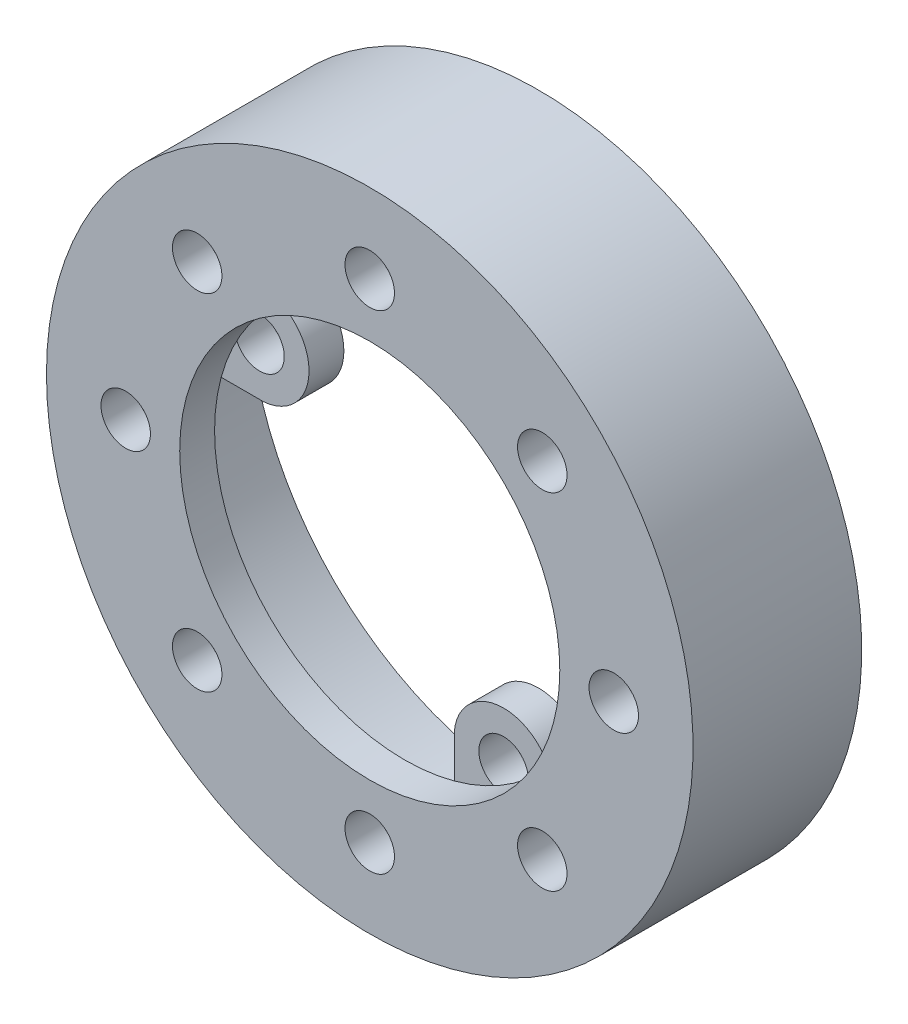
ISO-10303-21;
HEADER;
FILE_DESCRIPTION(('STEP AP214'),'2;1');
FILE_NAME('part.step','',(''),(''),'','','');
FILE_SCHEMA(('AUTOMOTIVE_DESIGN { 1 0 10303 214 1 1 1 1 }'));
ENDSEC;
DATA;
#1=APPLICATION_CONTEXT('core data for automotive mechanical design processes');
#2=APPLICATION_PROTOCOL_DEFINITION('international standard','automotive_design',2000,#1);
#3=PRODUCT_CONTEXT('',#1,'mechanical');
#4=PRODUCT('Part','Part','',(#3));
#5=PRODUCT_RELATED_PRODUCT_CATEGORY('part','',(#4));
#6=PRODUCT_DEFINITION_FORMATION('','',#4);
#7=PRODUCT_DEFINITION_CONTEXT('part definition',#1,'design');
#8=PRODUCT_DEFINITION('design','',#6,#7);
#9=PRODUCT_DEFINITION_SHAPE('','',#8);
#10=(LENGTH_UNIT() NAMED_UNIT(*) SI_UNIT(.MILLI.,.METRE.));
#11=(NAMED_UNIT(*) PLANE_ANGLE_UNIT() SI_UNIT($,.RADIAN.));
#12=(NAMED_UNIT(*) SI_UNIT($,.STERADIAN.) SOLID_ANGLE_UNIT());
#13=UNCERTAINTY_MEASURE_WITH_UNIT(LENGTH_MEASURE(1.E-05),#10,'distance_accuracy_value','');
#14=(GEOMETRIC_REPRESENTATION_CONTEXT(3) GLOBAL_UNCERTAINTY_ASSIGNED_CONTEXT((#13)) GLOBAL_UNIT_ASSIGNED_CONTEXT((#10,
#11,#12)) REPRESENTATION_CONTEXT('',''));
#15=CARTESIAN_POINT('',(0.,0.,0.));
#16=DIRECTION('',(0.,0.,1.));
#17=DIRECTION('',(1.,0.,0.));
#18=AXIS2_PLACEMENT_3D('',#15,#16,#17);
#19=CARTESIAN_POINT('',(0.,0.,-38.1));
#20=DIRECTION('',(0.,0.,-1.));
#21=DIRECTION('',(-1.,0.,0.));
#22=AXIS2_PLACEMENT_3D('',#19,#20,#21);
#23=CYLINDRICAL_SURFACE('',#22,65.278);
#24=CARTESIAN_POINT('',(0.,0.,-38.1));
#25=DIRECTION('',(0.,0.,-1.));
#26=DIRECTION('',(-1.,0.,0.));
#27=AXIS2_PLACEMENT_3D('',#24,#25,#26);
#28=CIRCLE('',#27,65.278);
#29=CARTESIAN_POINT('',(11.1349764420715,64.3212996108949,-38.1));
#30=VERTEX_POINT('',#29);
#31=CARTESIAN_POINT('',(64.3212996108948,11.1349764420721,-38.1));
#32=VERTEX_POINT('',#31);
#33=EDGE_CURVE('E11',#30,#32,#28,.T.);
#34=ORIENTED_EDGE('',*,*,#33,.T.);
#35=DIRECTION('',(0.,0.,-1.));
#36=VECTOR('',#35,1.);
#37=CARTESIAN_POINT('',(64.3212996108948,11.1349764420721,-30.226));
#38=LINE('',#37,#36);
#39=CARTESIAN_POINT('',(64.3212996108948,11.1349764420721,-30.226));
#40=VERTEX_POINT('',#39);
#41=EDGE_CURVE('E47',#40,#32,#38,.T.);
#42=ORIENTED_EDGE('',*,*,#41,.F.);
#43=CARTESIAN_POINT('',(0.,0.,-30.226));
#44=DIRECTION('',(0.,0.,-1.));
#45=DIRECTION('',(-1.,0.,0.));
#46=AXIS2_PLACEMENT_3D('',#43,#44,#45);
#47=CIRCLE('',#46,65.278);
#48=CARTESIAN_POINT('',(64.3212996108951,-11.1349764420708,-30.226));
#49=VERTEX_POINT('',#48);
#50=EDGE_CURVE('E51',#40,#49,#47,.T.);
#51=ORIENTED_EDGE('',*,*,#50,.T.);
#52=DIRECTION('',(0.,0.,-1.));
#53=VECTOR('',#52,1.);
#54=CARTESIAN_POINT('',(64.3212996108951,-11.1349764420708,-30.226));
#55=LINE('',#54,#53);
#56=CARTESIAN_POINT('',(64.3212996108951,-11.1349764420708,-38.1));
#57=VERTEX_POINT('',#56);
#58=EDGE_CURVE('E156',#49,#57,#55,.T.);
#59=ORIENTED_EDGE('',*,*,#58,.T.);
#60=CARTESIAN_POINT('',(11.1349764420719,-64.3212996108949,-38.1));
#61=VERTEX_POINT('',#60);
#62=EDGE_CURVE('E40',#57,#61,#28,.T.);
#63=ORIENTED_EDGE('',*,*,#62,.T.);
#64=DIRECTION('',(0.,0.,-1.));
#65=VECTOR('',#64,1.);
#66=CARTESIAN_POINT('',(11.1349764420719,-64.3212996108949,-30.226));
#67=LINE('',#66,#65);
#68=CARTESIAN_POINT('',(11.1349764420719,-64.3212996108949,-30.226));
#69=VERTEX_POINT('',#68);
#70=EDGE_CURVE('E208',#69,#61,#67,.T.);
#71=ORIENTED_EDGE('',*,*,#70,.F.);
#72=CARTESIAN_POINT('',(0.,0.,-30.226));
#73=DIRECTION('',(0.,0.,-1.));
#74=DIRECTION('',(-1.,0.,0.));
#75=AXIS2_PLACEMENT_3D('',#72,#73,#74);
#76=CIRCLE('',#75,65.278);
#77=CARTESIAN_POINT('',(-11.134976442071,-64.321299610895,-30.226));
#78=VERTEX_POINT('',#77);
#79=EDGE_CURVE('E188',#69,#78,#76,.T.);
#80=ORIENTED_EDGE('',*,*,#79,.T.);
#81=DIRECTION('',(0.,0.,-1.));
#82=VECTOR('',#81,1.);
#83=CARTESIAN_POINT('',(-11.134976442071,-64.321299610895,-30.226));
#84=LINE('',#83,#82);
#85=CARTESIAN_POINT('',(-11.134976442071,-64.321299610895,-38.1));
#86=VERTEX_POINT('',#85);
#87=EDGE_CURVE('E200',#78,#86,#84,.T.);
#88=ORIENTED_EDGE('',*,*,#87,.T.);
#89=CARTESIAN_POINT('',(-64.3212996108949,-11.1349764420717,-38.1));
#90=VERTEX_POINT('',#89);
#91=EDGE_CURVE('E352',#86,#90,#28,.T.);
#92=ORIENTED_EDGE('',*,*,#91,.T.);
#93=DIRECTION('',(0.,0.,-1.));
#94=VECTOR('',#93,1.);
#95=CARTESIAN_POINT('',(-64.3212996108949,-11.1349764420717,-30.226));
#96=LINE('',#95,#94);
#97=CARTESIAN_POINT('',(-64.3212996108949,-11.1349764420717,-30.226));
#98=VERTEX_POINT('',#97);
#99=EDGE_CURVE('E244',#98,#90,#96,.T.);
#100=ORIENTED_EDGE('',*,*,#99,.F.);
#101=CARTESIAN_POINT('',(0.,0.,-30.226));
#102=DIRECTION('',(0.,0.,-1.));
#103=DIRECTION('',(-1.,0.,0.));
#104=AXIS2_PLACEMENT_3D('',#101,#102,#103);
#105=CIRCLE('',#104,65.278);
#106=CARTESIAN_POINT('',(-64.321299610895,11.1349764420712,-30.226));
#107=VERTEX_POINT('',#106);
#108=EDGE_CURVE('E224',#98,#107,#105,.T.);
#109=ORIENTED_EDGE('',*,*,#108,.T.);
#110=DIRECTION('',(0.,0.,-1.));
#111=VECTOR('',#110,1.);
#112=CARTESIAN_POINT('',(-64.321299610895,11.1349764420712,-30.226));
#113=LINE('',#112,#111);
#114=CARTESIAN_POINT('',(-64.321299610895,11.1349764420712,-38.1));
#115=VERTEX_POINT('',#114);
#116=EDGE_CURVE('E236',#107,#115,#113,.T.);
#117=ORIENTED_EDGE('',*,*,#116,.T.);
#118=CARTESIAN_POINT('',(-11.1349764420715,64.3212996108949,-38.1));
#119=VERTEX_POINT('',#118);
#120=EDGE_CURVE('E41',#115,#119,#28,.T.);
#121=ORIENTED_EDGE('',*,*,#120,.T.);
#122=DIRECTION('',(0.,0.,-1.));
#123=VECTOR('',#122,1.);
#124=CARTESIAN_POINT('',(-11.1349764420715,64.3212996108949,-30.226));
#125=LINE('',#124,#123);
#126=CARTESIAN_POINT('',(-11.1349764420715,64.3212996108949,-30.226));
#127=VERTEX_POINT('',#126);
#128=EDGE_CURVE('E280',#127,#119,#125,.T.);
#129=ORIENTED_EDGE('',*,*,#128,.F.);
#130=CARTESIAN_POINT('',(0.,0.,-30.226));
#131=DIRECTION('',(0.,0.,-1.));
#132=DIRECTION('',(-1.,0.,0.));
#133=AXIS2_PLACEMENT_3D('',#130,#131,#132);
#134=CIRCLE('',#133,65.278);
#135=CARTESIAN_POINT('',(11.1349764420715,64.3212996108949,-30.226));
#136=VERTEX_POINT('',#135);
#137=EDGE_CURVE('E260',#127,#136,#134,.T.);
#138=ORIENTED_EDGE('',*,*,#137,.T.);
#139=DIRECTION('',(0.,0.,-1.));
#140=VECTOR('',#139,1.);
#141=CARTESIAN_POINT('',(11.1349764420715,64.3212996108949,-30.226));
#142=LINE('',#141,#140);
#143=EDGE_CURVE('E272',#136,#30,#142,.T.);
#144=ORIENTED_EDGE('',*,*,#143,.T.);
#145=EDGE_LOOP('',(#34,#42,#51,#59,#63,#71,#80,#88,#92,#100,#109,#117,#121,#129,#138,#144));
#146=FACE_BOUND('',#145,.T.);
#147=CARTESIAN_POINT('',(0.,0.,-7.874));
#148=DIRECTION('',(0.,0.,-1.));
#149=DIRECTION('',(-1.,0.,0.));
#150=AXIS2_PLACEMENT_3D('',#147,#148,#149);
#151=CIRCLE('',#150,65.278);
#152=CARTESIAN_POINT('',(-65.278,0.,-7.874));
#153=VERTEX_POINT('',#152);
#154=EDGE_CURVE('E293',#153,#153,#151,.T.);
#155=ORIENTED_EDGE('',*,*,#154,.F.);
#156=EDGE_LOOP('',(#155));
#157=FACE_BOUND('',#156,.T.);
#158=ADVANCED_FACE('F33',(#146,#157),#23,.F.);
#159=CARTESIAN_POINT('',(65.278,0.,-38.1));
#160=DIRECTION('',(0.,0.,1.));
#161=DIRECTION('',(1.,0.,0.));
#162=AXIS2_PLACEMENT_3D('',#159,#160,#161);
#163=PLANE('',#162);
#164=ORIENTED_EDGE('',*,*,#33,.F.);
#165=DIRECTION('',(0.,-1.,0.));
#166=VECTOR('',#165,1.);
#167=CARTESIAN_POINT('',(11.1349764420715,54.1612996108949,-38.1));
#168=LINE('',#167,#166);
#169=CARTESIAN_POINT('',(11.1349764420715,54.1612996108949,-38.1));
#170=VERTEX_POINT('',#169);
#171=EDGE_CURVE('E257',#30,#170,#168,.T.);
#172=ORIENTED_EDGE('',*,*,#171,.T.);
#173=CARTESIAN_POINT('',(0.,55.118,-38.1));
#174=DIRECTION('',(0.,0.,-1.));
#175=DIRECTION('',(1.,0.,0.));
#176=AXIS2_PLACEMENT_3D('',#173,#174,#175);
#177=CIRCLE('',#176,11.176);
#178=CARTESIAN_POINT('',(-11.1349764420715,54.1612996108949,-38.1));
#179=VERTEX_POINT('',#178);
#180=EDGE_CURVE('E275',#170,#179,#177,.T.);
#181=ORIENTED_EDGE('',*,*,#180,.T.);
#182=DIRECTION('',(0.,1.,0.));
#183=VECTOR('',#182,1.);
#184=CARTESIAN_POINT('',(-11.1349764420715,54.1612996108949,-38.1));
#185=LINE('',#184,#183);
#186=EDGE_CURVE('E263',#179,#119,#185,.T.);
#187=ORIENTED_EDGE('',*,*,#186,.T.);
#188=ORIENTED_EDGE('',*,*,#120,.F.);
#189=DIRECTION('',(1.,0.,0.));
#190=VECTOR('',#189,1.);
#191=CARTESIAN_POINT('',(-54.161299610895,11.1349764420713,-38.1));
#192=LINE('',#191,#190);
#193=CARTESIAN_POINT('',(-54.161299610895,11.1349764420713,-38.1));
#194=VERTEX_POINT('',#193);
#195=EDGE_CURVE('E221',#115,#194,#192,.T.);
#196=ORIENTED_EDGE('',*,*,#195,.T.);
#197=CARTESIAN_POINT('',(-55.118,-1.92443468434356E-13,-38.1));
#198=DIRECTION('',(0.,0.,-1.));
#199=DIRECTION('',(1.,0.,0.));
#200=AXIS2_PLACEMENT_3D('',#197,#198,#199);
#201=CIRCLE('',#200,11.176);
#202=CARTESIAN_POINT('',(-54.1612996108949,-11.1349764420716,-38.1));
#203=VERTEX_POINT('',#202);
#204=EDGE_CURVE('E239',#194,#203,#201,.T.);
#205=ORIENTED_EDGE('',*,*,#204,.T.);
#206=DIRECTION('',(-1.,0.,0.));
#207=VECTOR('',#206,1.);
#208=CARTESIAN_POINT('',(-54.1612996108949,-11.1349764420716,-38.1));
#209=LINE('',#208,#207);
#210=EDGE_CURVE('E227',#203,#90,#209,.T.);
#211=ORIENTED_EDGE('',*,*,#210,.T.);
#212=ORIENTED_EDGE('',*,*,#91,.F.);
#213=DIRECTION('',(0.,1.,0.));
#214=VECTOR('',#213,1.);
#215=CARTESIAN_POINT('',(-11.1349764420711,-54.161299610895,-38.1));
#216=LINE('',#215,#214);
#217=CARTESIAN_POINT('',(-11.1349764420711,-54.161299610895,-38.1));
#218=VERTEX_POINT('',#217);
#219=EDGE_CURVE('E185',#86,#218,#216,.T.);
#220=ORIENTED_EDGE('',*,*,#219,.T.);
#221=CARTESIAN_POINT('',(3.84886936868712E-13,-55.118,-38.1));
#222=DIRECTION('',(0.,0.,-1.));
#223=DIRECTION('',(1.,0.,0.));
#224=AXIS2_PLACEMENT_3D('',#221,#222,#223);
#225=CIRCLE('',#224,11.176);
#226=CARTESIAN_POINT('',(11.1349764420718,-54.1612996108949,-38.1));
#227=VERTEX_POINT('',#226);
#228=EDGE_CURVE('E203',#218,#227,#225,.T.);
#229=ORIENTED_EDGE('',*,*,#228,.T.);
#230=DIRECTION('',(0.,-1.,0.));
#231=VECTOR('',#230,1.);
#232=CARTESIAN_POINT('',(11.1349764420718,-54.1612996108949,-38.1));
#233=LINE('',#232,#231);
#234=EDGE_CURVE('E191',#227,#61,#233,.T.);
#235=ORIENTED_EDGE('',*,*,#234,.T.);
#236=ORIENTED_EDGE('',*,*,#62,.F.);
#237=DIRECTION('',(-1.,0.,0.));
#238=VECTOR('',#237,1.);
#239=CARTESIAN_POINT('',(54.1612996108951,-11.1349764420709,-38.1));
#240=LINE('',#239,#238);
#241=CARTESIAN_POINT('',(54.1612996108951,-11.1349764420709,-38.1));
#242=VERTEX_POINT('',#241);
#243=EDGE_CURVE('E172',#57,#242,#240,.T.);
#244=ORIENTED_EDGE('',*,*,#243,.T.);
#245=CARTESIAN_POINT('',(55.118,5.77330405303067E-13,-38.1));
#246=DIRECTION('',(0.,0.,-1.));
#247=DIRECTION('',(1.,0.,0.));
#248=AXIS2_PLACEMENT_3D('',#245,#246,#247);
#249=CIRCLE('',#248,11.176);
#250=CARTESIAN_POINT('',(54.1612996108948,11.134976442072,-38.1));
#251=VERTEX_POINT('',#250);
#252=EDGE_CURVE('E150',#242,#251,#249,.T.);
#253=ORIENTED_EDGE('',*,*,#252,.T.);
#254=DIRECTION('',(1.,0.,0.));
#255=VECTOR('',#254,1.);
#256=CARTESIAN_POINT('',(54.1612996108948,11.134976442072,-38.1));
#257=LINE('',#256,#255);
#258=EDGE_CURVE('E167',#251,#32,#257,.T.);
#259=ORIENTED_EDGE('',*,*,#258,.T.);
#260=EDGE_LOOP('',(#164,#172,#181,#187,#188,#196,#205,#211,#212,#220,#229,#235,#236,#244,#253,#259));
#261=FACE_BOUND('',#260,.T.);
#262=CARTESIAN_POINT('',(0.,0.,-38.1));
#263=DIRECTION('',(0.,0.,-1.));
#264=DIRECTION('',(-1.,0.,0.));
#265=AXIS2_PLACEMENT_3D('',#262,#263,#264);
#266=CIRCLE('',#265,73.025);
#267=CARTESIAN_POINT('',(-73.025,0.,-38.1));
#268=VERTEX_POINT('',#267);
#269=EDGE_CURVE('E348',#268,#268,#266,.T.);
#270=ORIENTED_EDGE('',*,*,#269,.T.);
#271=EDGE_LOOP('',(#270));
#272=FACE_BOUND('',#271,.T.);
#273=CARTESIAN_POINT('',(0.,55.118,-38.1));
#274=DIRECTION('',(0.,0.,-1.));
#275=DIRECTION('',(-1.,0.,0.));
#276=AXIS2_PLACEMENT_3D('',#273,#274,#275);
#277=CIRCLE('',#276,5.588);
#278=CARTESIAN_POINT('',(-5.588,55.118,-38.1));
#279=VERTEX_POINT('',#278);
#280=EDGE_CURVE('E247',#279,#279,#277,.T.);
#281=ORIENTED_EDGE('',*,*,#280,.F.);
#282=EDGE_LOOP('',(#281));
#283=FACE_BOUND('',#282,.T.);
#284=CARTESIAN_POINT('',(-55.118,-1.92443468434356E-13,-38.1));
#285=DIRECTION('',(0.,0.,-1.));
#286=DIRECTION('',(-1.,0.,0.));
#287=AXIS2_PLACEMENT_3D('',#284,#285,#286);
#288=CIRCLE('',#287,5.588);
#289=CARTESIAN_POINT('',(-60.706,-1.92443468434356E-13,-38.1));
#290=VERTEX_POINT('',#289);
#291=EDGE_CURVE('E211',#290,#290,#288,.T.);
#292=ORIENTED_EDGE('',*,*,#291,.F.);
#293=EDGE_LOOP('',(#292));
#294=FACE_BOUND('',#293,.T.);
#295=CARTESIAN_POINT('',(3.84886936868712E-13,-55.118,-38.1));
#296=DIRECTION('',(0.,0.,-1.));
#297=DIRECTION('',(-1.,0.,0.));
#298=AXIS2_PLACEMENT_3D('',#295,#296,#297);
#299=CIRCLE('',#298,5.588);
#300=CARTESIAN_POINT('',(-5.58799999999962,-55.118,-38.1));
#301=VERTEX_POINT('',#300);
#302=EDGE_CURVE('E179',#301,#301,#299,.T.);
#303=ORIENTED_EDGE('',*,*,#302,.F.);
#304=EDGE_LOOP('',(#303));
#305=FACE_BOUND('',#304,.T.);
#306=CARTESIAN_POINT('',(55.118,5.77330405303067E-13,-38.1));
#307=DIRECTION('',(0.,0.,-1.));
#308=DIRECTION('',(-1.,0.,0.));
#309=AXIS2_PLACEMENT_3D('',#306,#307,#308);
#310=CIRCLE('',#309,5.588);
#311=CARTESIAN_POINT('',(49.53,5.77330405303067E-13,-38.1));
#312=VERTEX_POINT('',#311);
#313=EDGE_CURVE('E489',#312,#312,#310,.T.);
#314=ORIENTED_EDGE('',*,*,#313,.F.);
#315=EDGE_LOOP('',(#314));
#316=FACE_BOUND('',#315,.T.);
#317=ADVANCED_FACE('F360',(#261,#272,#283,#294,#305,#316),#163,.F.);
#318=CARTESIAN_POINT('',(0.,0.,-38.1));
#319=DIRECTION('',(0.,0.,-1.));
#320=DIRECTION('',(-1.,0.,0.));
#321=AXIS2_PLACEMENT_3D('',#318,#319,#320);
#322=CYLINDRICAL_SURFACE('',#321,73.025);
#323=ORIENTED_EDGE('',*,*,#269,.F.);
#324=EDGE_LOOP('',(#323));
#325=FACE_BOUND('',#324,.T.);
#326=CARTESIAN_POINT('',(0.,0.,0.));
#327=DIRECTION('',(0.,0.,-1.));
#328=DIRECTION('',(-1.,0.,0.));
#329=AXIS2_PLACEMENT_3D('',#326,#327,#328);
#330=CIRCLE('',#329,73.025);
#331=CARTESIAN_POINT('',(-73.025,0.,0.));
#332=VERTEX_POINT('',#331);
#333=EDGE_CURVE('E346',#332,#332,#330,.T.);
#334=ORIENTED_EDGE('',*,*,#333,.T.);
#335=EDGE_LOOP('',(#334));
#336=FACE_BOUND('',#335,.T.);
#337=ADVANCED_FACE('F387',(#325,#336),#322,.T.);
#338=CARTESIAN_POINT('',(42.926,0.,0.));
#339=DIRECTION('',(0.,0.,-1.));
#340=DIRECTION('',(-1.,0.,0.));
#341=AXIS2_PLACEMENT_3D('',#338,#339,#340);
#342=PLANE('',#341);
#343=CARTESIAN_POINT('',(0.,55.118,0.));
#344=DIRECTION('',(0.,0.,-1.));
#345=DIRECTION('',(-1.,0.,0.));
#346=AXIS2_PLACEMENT_3D('',#343,#344,#345);
#347=CIRCLE('',#346,5.588);
#348=CARTESIAN_POINT('',(-5.588,55.118,0.));
#349=VERTEX_POINT('',#348);
#350=EDGE_CURVE('E290',#349,#349,#347,.T.);
#351=ORIENTED_EDGE('',*,*,#350,.T.);
#352=EDGE_LOOP('',(#351));
#353=FACE_BOUND('',#352,.T.);
#354=CARTESIAN_POINT('',(-38.9743115654408,38.9743115654418,0.));
#355=DIRECTION('',(0.,0.,-1.));
#356=DIRECTION('',(-1.,0.,0.));
#357=AXIS2_PLACEMENT_3D('',#354,#355,#356);
#358=CIRCLE('',#357,5.58800000000027);
#359=CARTESIAN_POINT('',(-44.5623115654411,38.9743115654418,0.));
#360=VERTEX_POINT('',#359);
#361=EDGE_CURVE('E297',#360,#360,#358,.T.);
#362=ORIENTED_EDGE('',*,*,#361,.T.);
#363=EDGE_LOOP('',(#362));
#364=FACE_BOUND('',#363,.T.);
#365=CARTESIAN_POINT('',(-55.1180000000023,2.3396966582362E-12,0.));
#366=DIRECTION('',(0.,0.,-1.));
#367=DIRECTION('',(-1.,0.,0.));
#368=AXIS2_PLACEMENT_3D('',#365,#366,#367);
#369=CIRCLE('',#368,5.58800000000173);
#370=CARTESIAN_POINT('',(-60.7060000000041,2.3396966582362E-12,0.));
#371=VERTEX_POINT('',#370);
#372=EDGE_CURVE('E303',#371,#371,#369,.T.);
#373=ORIENTED_EDGE('',*,*,#372,.T.);
#374=EDGE_LOOP('',(#373));
#375=FACE_BOUND('',#374,.T.);
#376=CARTESIAN_POINT('',(-38.9743115654441,-38.9743115654385,0.));
#377=DIRECTION('',(0.,0.,-1.));
#378=DIRECTION('',(-1.,0.,0.));
#379=AXIS2_PLACEMENT_3D('',#376,#377,#378);
#380=CIRCLE('',#379,5.58800000000361);
#381=CARTESIAN_POINT('',(-44.5623115654477,-38.9743115654385,0.));
#382=VERTEX_POINT('',#381);
#383=EDGE_CURVE('E309',#382,#382,#380,.T.);
#384=ORIENTED_EDGE('',*,*,#383,.T.);
#385=EDGE_LOOP('',(#384));
#386=FACE_BOUND('',#385,.T.);
#387=CARTESIAN_POINT('',(-4.6793933164724E-12,-55.118,0.));
#388=DIRECTION('',(0.,0.,-1.));
#389=DIRECTION('',(-1.,0.,0.));
#390=AXIS2_PLACEMENT_3D('',#387,#388,#389);
#391=CIRCLE('',#390,5.58800000000484);
#392=CARTESIAN_POINT('',(-5.58800000000952,-55.118,0.));
#393=VERTEX_POINT('',#392);
#394=EDGE_CURVE('E315',#393,#393,#391,.T.);
#395=ORIENTED_EDGE('',*,*,#394,.T.);
#396=EDGE_LOOP('',(#395));
#397=FACE_BOUND('',#396,.T.);
#398=CARTESIAN_POINT('',(38.9743115654361,-38.9743115654418,0.));
#399=DIRECTION('',(0.,0.,-1.));
#400=DIRECTION('',(-1.,0.,0.));
#401=AXIS2_PLACEMENT_3D('',#398,#399,#400);
#402=CIRCLE('',#401,5.58800000000475);
#403=CARTESIAN_POINT('',(33.3863115654314,-38.9743115654418,0.));
#404=VERTEX_POINT('',#403);
#405=EDGE_CURVE('E321',#404,#404,#402,.T.);
#406=ORIENTED_EDGE('',*,*,#405,.T.);
#407=EDGE_LOOP('',(#406));
#408=FACE_BOUND('',#407,.T.);
#409=CARTESIAN_POINT('',(55.1179999999977,-2.34644666646374E-12,0.));
#410=DIRECTION('',(0.,0.,-1.));
#411=DIRECTION('',(-1.,0.,0.));
#412=AXIS2_PLACEMENT_3D('',#409,#410,#411);
#413=CIRCLE('',#412,5.58800000000348);
#414=CARTESIAN_POINT('',(49.5299999999942,-2.34644666646374E-12,0.));
#415=VERTEX_POINT('',#414);
#416=EDGE_CURVE('E327',#415,#415,#413,.T.);
#417=ORIENTED_EDGE('',*,*,#416,.T.);
#418=EDGE_LOOP('',(#417));
#419=FACE_BOUND('',#418,.T.);
#420=CARTESIAN_POINT('',(38.9743115654395,38.9743115654385,0.));
#421=DIRECTION('',(0.,0.,-1.));
#422=DIRECTION('',(-1.,0.,0.));
#423=AXIS2_PLACEMENT_3D('',#420,#421,#422);
#424=CIRCLE('',#423,5.5880000000018);
#425=CARTESIAN_POINT('',(33.3863115654377,38.9743115654385,0.));
#426=VERTEX_POINT('',#425);
#427=EDGE_CURVE('E333',#426,#426,#424,.T.);
#428=ORIENTED_EDGE('',*,*,#427,.T.);
#429=EDGE_LOOP('',(#428));
#430=FACE_BOUND('',#429,.T.);
#431=ORIENTED_EDGE('',*,*,#333,.F.);
#432=EDGE_LOOP('',(#431));
#433=FACE_BOUND('',#432,.T.);
#434=CARTESIAN_POINT('',(0.,0.,0.));
#435=DIRECTION('',(0.,0.,-1.));
#436=DIRECTION('',(-1.,0.,0.));
#437=AXIS2_PLACEMENT_3D('',#434,#435,#436);
#438=CIRCLE('',#437,42.926);
#439=CARTESIAN_POINT('',(-42.926,0.,0.));
#440=VERTEX_POINT('',#439);
#441=EDGE_CURVE('E343',#440,#440,#438,.T.);
#442=ORIENTED_EDGE('',*,*,#441,.T.);
#443=EDGE_LOOP('',(#442));
#444=FACE_BOUND('',#443,.T.);
#445=ADVANCED_FACE('F391',(#353,#364,#375,#386,#397,#408,#419,#430,#433,#444),#342,.F.);
#446=CARTESIAN_POINT('',(0.,0.,-38.1));
#447=DIRECTION('',(0.,0.,-1.));
#448=DIRECTION('',(-1.,0.,0.));
#449=AXIS2_PLACEMENT_3D('',#446,#447,#448);
#450=CYLINDRICAL_SURFACE('',#449,42.926);
#451=ORIENTED_EDGE('',*,*,#441,.F.);
#452=EDGE_LOOP('',(#451));
#453=FACE_BOUND('',#452,.T.);
#454=CARTESIAN_POINT('',(0.,0.,-7.874));
#455=DIRECTION('',(0.,0.,-1.));
#456=DIRECTION('',(-1.,0.,0.));
#457=AXIS2_PLACEMENT_3D('',#454,#455,#456);
#458=CIRCLE('',#457,42.926);
#459=CARTESIAN_POINT('',(-42.926,0.,-7.874));
#460=VERTEX_POINT('',#459);
#461=EDGE_CURVE('E340',#460,#460,#458,.T.);
#462=ORIENTED_EDGE('',*,*,#461,.T.);
#463=EDGE_LOOP('',(#462));
#464=FACE_BOUND('',#463,.T.);
#465=ADVANCED_FACE('F397',(#453,#464),#450,.F.);
#466=CARTESIAN_POINT('',(42.926,0.,-7.874));
#467=DIRECTION('',(0.,0.,1.));
#468=DIRECTION('',(1.,0.,0.));
#469=AXIS2_PLACEMENT_3D('',#466,#467,#468);
#470=PLANE('',#469);
#471=CARTESIAN_POINT('',(0.,55.118,-7.874));
#472=DIRECTION('',(0.,0.,-1.));
#473=DIRECTION('',(-1.,0.,0.));
#474=AXIS2_PLACEMENT_3D('',#471,#472,#473);
#475=CIRCLE('',#474,5.588);
#476=CARTESIAN_POINT('',(-5.588,55.118,-7.874));
#477=VERTEX_POINT('',#476);
#478=EDGE_CURVE('E294',#477,#477,#475,.T.);
#479=ORIENTED_EDGE('',*,*,#478,.F.);
#480=EDGE_LOOP('',(#479));
#481=FACE_BOUND('',#480,.T.);
#482=CARTESIAN_POINT('',(-38.9743115654408,38.9743115654418,-7.874));
#483=DIRECTION('',(0.,0.,-1.));
#484=DIRECTION('',(-1.,0.,0.));
#485=AXIS2_PLACEMENT_3D('',#482,#483,#484);
#486=CIRCLE('',#485,5.58800000000027);
#487=CARTESIAN_POINT('',(-44.5623115654411,38.9743115654418,-7.874));
#488=VERTEX_POINT('',#487);
#489=EDGE_CURVE('E300',#488,#488,#486,.T.);
#490=ORIENTED_EDGE('',*,*,#489,.F.);
#491=EDGE_LOOP('',(#490));
#492=FACE_BOUND('',#491,.T.);
#493=CARTESIAN_POINT('',(-55.1180000000023,2.3396966582362E-12,-7.874));
#494=DIRECTION('',(0.,0.,-1.));
#495=DIRECTION('',(-1.,0.,0.));
#496=AXIS2_PLACEMENT_3D('',#493,#494,#495);
#497=CIRCLE('',#496,5.58800000000173);
#498=CARTESIAN_POINT('',(-60.7060000000041,2.3396966582362E-12,-7.874));
#499=VERTEX_POINT('',#498);
#500=EDGE_CURVE('E306',#499,#499,#497,.T.);
#501=ORIENTED_EDGE('',*,*,#500,.F.);
#502=EDGE_LOOP('',(#501));
#503=FACE_BOUND('',#502,.T.);
#504=CARTESIAN_POINT('',(-38.9743115654441,-38.9743115654385,-7.874));
#505=DIRECTION('',(0.,0.,-1.));
#506=DIRECTION('',(-1.,0.,0.));
#507=AXIS2_PLACEMENT_3D('',#504,#505,#506);
#508=CIRCLE('',#507,5.58800000000361);
#509=CARTESIAN_POINT('',(-44.5623115654477,-38.9743115654385,-7.874));
#510=VERTEX_POINT('',#509);
#511=EDGE_CURVE('E312',#510,#510,#508,.T.);
#512=ORIENTED_EDGE('',*,*,#511,.F.);
#513=EDGE_LOOP('',(#512));
#514=FACE_BOUND('',#513,.T.);
#515=CARTESIAN_POINT('',(-4.6793933164724E-12,-55.118,-7.874));
#516=DIRECTION('',(0.,0.,-1.));
#517=DIRECTION('',(-1.,0.,0.));
#518=AXIS2_PLACEMENT_3D('',#515,#516,#517);
#519=CIRCLE('',#518,5.58800000000484);
#520=CARTESIAN_POINT('',(-5.58800000000952,-55.118,-7.874));
#521=VERTEX_POINT('',#520);
#522=EDGE_CURVE('E318',#521,#521,#519,.T.);
#523=ORIENTED_EDGE('',*,*,#522,.F.);
#524=EDGE_LOOP('',(#523));
#525=FACE_BOUND('',#524,.T.);
#526=CARTESIAN_POINT('',(38.9743115654361,-38.9743115654418,-7.874));
#527=DIRECTION('',(0.,0.,-1.));
#528=DIRECTION('',(-1.,0.,0.));
#529=AXIS2_PLACEMENT_3D('',#526,#527,#528);
#530=CIRCLE('',#529,5.58800000000475);
#531=CARTESIAN_POINT('',(33.3863115654314,-38.9743115654418,-7.874));
#532=VERTEX_POINT('',#531);
#533=EDGE_CURVE('E324',#532,#532,#530,.T.);
#534=ORIENTED_EDGE('',*,*,#533,.F.);
#535=EDGE_LOOP('',(#534));
#536=FACE_BOUND('',#535,.T.);
#537=CARTESIAN_POINT('',(55.1179999999977,-2.34644666646374E-12,-7.874));
#538=DIRECTION('',(0.,0.,-1.));
#539=DIRECTION('',(-1.,0.,0.));
#540=AXIS2_PLACEMENT_3D('',#537,#538,#539);
#541=CIRCLE('',#540,5.58800000000348);
#542=CARTESIAN_POINT('',(49.5299999999942,-2.34644666646374E-12,-7.874));
#543=VERTEX_POINT('',#542);
#544=EDGE_CURVE('E330',#543,#543,#541,.T.);
#545=ORIENTED_EDGE('',*,*,#544,.F.);
#546=EDGE_LOOP('',(#545));
#547=FACE_BOUND('',#546,.T.);
#548=CARTESIAN_POINT('',(38.9743115654395,38.9743115654385,-7.874));
#549=DIRECTION('',(0.,0.,-1.));
#550=DIRECTION('',(-1.,0.,0.));
#551=AXIS2_PLACEMENT_3D('',#548,#549,#550);
#552=CIRCLE('',#551,5.5880000000018);
#553=CARTESIAN_POINT('',(33.3863115654377,38.9743115654385,-7.874));
#554=VERTEX_POINT('',#553);
#555=EDGE_CURVE('E283',#554,#554,#552,.T.);
#556=ORIENTED_EDGE('',*,*,#555,.F.);
#557=EDGE_LOOP('',(#556));
#558=FACE_BOUND('',#557,.T.);
#559=ORIENTED_EDGE('',*,*,#461,.F.);
#560=EDGE_LOOP('',(#559));
#561=FACE_BOUND('',#560,.T.);
#562=ORIENTED_EDGE('',*,*,#154,.T.);
#563=EDGE_LOOP('',(#562));
#564=FACE_BOUND('',#563,.T.);
#565=ADVANCED_FACE('F401',(#481,#492,#503,#514,#525,#536,#547,#558,#561,#564),#470,.F.);
#566=CARTESIAN_POINT('',(38.9743115654395,38.9743115654385,0.));
#567=DIRECTION('',(0.,0.,-1.));
#568=DIRECTION('',(-1.,0.,0.));
#569=AXIS2_PLACEMENT_3D('',#566,#567,#568);
#570=CYLINDRICAL_SURFACE('',#569,5.5880000000018);
#571=ORIENTED_EDGE('',*,*,#427,.F.);
#572=EDGE_LOOP('',(#571));
#573=FACE_BOUND('',#572,.T.);
#574=ORIENTED_EDGE('',*,*,#555,.T.);
#575=EDGE_LOOP('',(#574));
#576=FACE_BOUND('',#575,.T.);
#577=ADVANCED_FACE('F405',(#573,#576),#570,.F.);
#578=CARTESIAN_POINT('',(55.1179999999977,-2.34644666646374E-12,0.));
#579=DIRECTION('',(0.,0.,-1.));
#580=DIRECTION('',(-1.,0.,0.));
#581=AXIS2_PLACEMENT_3D('',#578,#579,#580);
#582=CYLINDRICAL_SURFACE('',#581,5.58800000000348);
#583=ORIENTED_EDGE('',*,*,#416,.F.);
#584=EDGE_LOOP('',(#583));
#585=FACE_BOUND('',#584,.T.);
#586=ORIENTED_EDGE('',*,*,#544,.T.);
#587=EDGE_LOOP('',(#586));
#588=FACE_BOUND('',#587,.T.);
#589=ADVANCED_FACE('F409',(#585,#588),#582,.F.);
#590=CARTESIAN_POINT('',(38.9743115654361,-38.9743115654418,0.));
#591=DIRECTION('',(0.,0.,-1.));
#592=DIRECTION('',(-1.,0.,0.));
#593=AXIS2_PLACEMENT_3D('',#590,#591,#592);
#594=CYLINDRICAL_SURFACE('',#593,5.58800000000475);
#595=ORIENTED_EDGE('',*,*,#405,.F.);
#596=EDGE_LOOP('',(#595));
#597=FACE_BOUND('',#596,.T.);
#598=ORIENTED_EDGE('',*,*,#533,.T.);
#599=EDGE_LOOP('',(#598));
#600=FACE_BOUND('',#599,.T.);
#601=ADVANCED_FACE('F413',(#597,#600),#594,.F.);
#602=CARTESIAN_POINT('',(-4.6793933164724E-12,-55.118,0.));
#603=DIRECTION('',(0.,0.,-1.));
#604=DIRECTION('',(-1.,0.,0.));
#605=AXIS2_PLACEMENT_3D('',#602,#603,#604);
#606=CYLINDRICAL_SURFACE('',#605,5.58800000000484);
#607=ORIENTED_EDGE('',*,*,#394,.F.);
#608=EDGE_LOOP('',(#607));
#609=FACE_BOUND('',#608,.T.);
#610=ORIENTED_EDGE('',*,*,#522,.T.);
#611=EDGE_LOOP('',(#610));
#612=FACE_BOUND('',#611,.T.);
#613=ADVANCED_FACE('F417',(#609,#612),#606,.F.);
#614=CARTESIAN_POINT('',(-38.9743115654441,-38.9743115654385,0.));
#615=DIRECTION('',(0.,0.,-1.));
#616=DIRECTION('',(-1.,0.,0.));
#617=AXIS2_PLACEMENT_3D('',#614,#615,#616);
#618=CYLINDRICAL_SURFACE('',#617,5.58800000000361);
#619=ORIENTED_EDGE('',*,*,#383,.F.);
#620=EDGE_LOOP('',(#619));
#621=FACE_BOUND('',#620,.T.);
#622=ORIENTED_EDGE('',*,*,#511,.T.);
#623=EDGE_LOOP('',(#622));
#624=FACE_BOUND('',#623,.T.);
#625=ADVANCED_FACE('F421',(#621,#624),#618,.F.);
#626=CARTESIAN_POINT('',(-55.1180000000023,2.3396966582362E-12,0.));
#627=DIRECTION('',(0.,0.,-1.));
#628=DIRECTION('',(-1.,0.,0.));
#629=AXIS2_PLACEMENT_3D('',#626,#627,#628);
#630=CYLINDRICAL_SURFACE('',#629,5.58800000000173);
#631=ORIENTED_EDGE('',*,*,#372,.F.);
#632=EDGE_LOOP('',(#631));
#633=FACE_BOUND('',#632,.T.);
#634=ORIENTED_EDGE('',*,*,#500,.T.);
#635=EDGE_LOOP('',(#634));
#636=FACE_BOUND('',#635,.T.);
#637=ADVANCED_FACE('F425',(#633,#636),#630,.F.);
#638=CARTESIAN_POINT('',(-38.9743115654408,38.9743115654418,0.));
#639=DIRECTION('',(0.,0.,-1.));
#640=DIRECTION('',(-1.,0.,0.));
#641=AXIS2_PLACEMENT_3D('',#638,#639,#640);
#642=CYLINDRICAL_SURFACE('',#641,5.58800000000027);
#643=ORIENTED_EDGE('',*,*,#361,.F.);
#644=EDGE_LOOP('',(#643));
#645=FACE_BOUND('',#644,.T.);
#646=ORIENTED_EDGE('',*,*,#489,.T.);
#647=EDGE_LOOP('',(#646));
#648=FACE_BOUND('',#647,.T.);
#649=ADVANCED_FACE('F429',(#645,#648),#642,.F.);
#650=CARTESIAN_POINT('',(0.,55.118,0.));
#651=DIRECTION('',(0.,0.,-1.));
#652=DIRECTION('',(-1.,0.,0.));
#653=AXIS2_PLACEMENT_3D('',#650,#651,#652);
#654=CYLINDRICAL_SURFACE('',#653,5.588);
#655=ORIENTED_EDGE('',*,*,#350,.F.);
#656=EDGE_LOOP('',(#655));
#657=FACE_BOUND('',#656,.T.);
#658=ORIENTED_EDGE('',*,*,#478,.T.);
#659=EDGE_LOOP('',(#658));
#660=FACE_BOUND('',#659,.T.);
#661=ADVANCED_FACE('F433',(#657,#660),#654,.F.);
#662=CARTESIAN_POINT('',(-11.1349764420715,54.1612996108949,-30.226));
#663=DIRECTION('',(-1.,0.,0.));
#664=DIRECTION('',(0.,0.,1.));
#665=AXIS2_PLACEMENT_3D('',#662,#663,#664);
#666=PLANE('',#665);
#667=ORIENTED_EDGE('',*,*,#186,.F.);
#668=DIRECTION('',(0.,0.,-1.));
#669=VECTOR('',#668,1.);
#670=CARTESIAN_POINT('',(-11.1349764420715,54.1612996108949,-30.226));
#671=LINE('',#670,#669);
#672=CARTESIAN_POINT('',(-11.1349764420715,54.1612996108949,-30.226));
#673=VERTEX_POINT('',#672);
#674=EDGE_CURVE('E284',#673,#179,#671,.T.);
#675=ORIENTED_EDGE('',*,*,#674,.F.);
#676=DIRECTION('',(0.,1.,0.));
#677=VECTOR('',#676,1.);
#678=CARTESIAN_POINT('',(-11.1349764420715,54.1612996108949,-30.226));
#679=LINE('',#678,#677);
#680=EDGE_CURVE('E269',#673,#127,#679,.T.);
#681=ORIENTED_EDGE('',*,*,#680,.T.);
#682=ORIENTED_EDGE('',*,*,#128,.T.);
#683=EDGE_LOOP('',(#667,#675,#681,#682));
#684=FACE_BOUND('',#683,.T.);
#685=ADVANCED_FACE('F437',(#684),#666,.T.);
#686=CARTESIAN_POINT('',(0.,55.118,-30.226));
#687=DIRECTION('',(0.,0.,-1.));
#688=DIRECTION('',(-1.,0.,0.));
#689=AXIS2_PLACEMENT_3D('',#686,#687,#688);
#690=CYLINDRICAL_SURFACE('',#689,11.176);
#691=ORIENTED_EDGE('',*,*,#180,.F.);
#692=DIRECTION('',(0.,0.,-1.));
#693=VECTOR('',#692,1.);
#694=CARTESIAN_POINT('',(11.1349764420715,54.1612996108949,-30.226));
#695=LINE('',#694,#693);
#696=CARTESIAN_POINT('',(11.1349764420715,54.1612996108949,-30.226));
#697=VERTEX_POINT('',#696);
#698=EDGE_CURVE('E286',#697,#170,#695,.T.);
#699=ORIENTED_EDGE('',*,*,#698,.F.);
#700=CARTESIAN_POINT('',(0.,55.118,-30.226));
#701=DIRECTION('',(0.,0.,-1.));
#702=DIRECTION('',(1.,0.,0.));
#703=AXIS2_PLACEMENT_3D('',#700,#701,#702);
#704=CIRCLE('',#703,11.176);
#705=EDGE_CURVE('E266',#697,#673,#704,.T.);
#706=ORIENTED_EDGE('',*,*,#705,.T.);
#707=ORIENTED_EDGE('',*,*,#674,.T.);
#708=EDGE_LOOP('',(#691,#699,#706,#707));
#709=FACE_BOUND('',#708,.T.);
#710=ADVANCED_FACE('F443',(#709),#690,.T.);
#711=CARTESIAN_POINT('',(11.1349764420715,54.1612996108949,-30.226));
#712=DIRECTION('',(1.,0.,0.));
#713=DIRECTION('',(0.,0.,-1.));
#714=AXIS2_PLACEMENT_3D('',#711,#712,#713);
#715=PLANE('',#714);
#716=ORIENTED_EDGE('',*,*,#171,.F.);
#717=ORIENTED_EDGE('',*,*,#143,.F.);
#718=DIRECTION('',(0.,-1.,0.));
#719=VECTOR('',#718,1.);
#720=CARTESIAN_POINT('',(11.1349764420715,54.1612996108949,-30.226));
#721=LINE('',#720,#719);
#722=EDGE_CURVE('E262',#136,#697,#721,.T.);
#723=ORIENTED_EDGE('',*,*,#722,.T.);
#724=ORIENTED_EDGE('',*,*,#698,.T.);
#725=EDGE_LOOP('',(#716,#717,#723,#724));
#726=FACE_BOUND('',#725,.T.);
#727=ADVANCED_FACE('F439',(#726),#715,.T.);
#728=CARTESIAN_POINT('',(0.,0.,-30.226));
#729=DIRECTION('',(0.,0.,-1.));
#730=DIRECTION('',(-1.,0.,0.));
#731=AXIS2_PLACEMENT_3D('',#728,#729,#730);
#732=PLANE('',#731);
#733=CARTESIAN_POINT('',(0.,55.118,-30.226));
#734=DIRECTION('',(0.,0.,-1.));
#735=DIRECTION('',(-1.,0.,0.));
#736=AXIS2_PLACEMENT_3D('',#733,#734,#735);
#737=CIRCLE('',#736,5.588);
#738=CARTESIAN_POINT('',(-5.588,55.118,-30.226));
#739=VERTEX_POINT('',#738);
#740=EDGE_CURVE('E254',#739,#739,#737,.T.);
#741=ORIENTED_EDGE('',*,*,#740,.T.);
#742=EDGE_LOOP('',(#741));
#743=FACE_BOUND('',#742,.T.);
#744=ORIENTED_EDGE('',*,*,#137,.F.);
#745=ORIENTED_EDGE('',*,*,#680,.F.);
#746=ORIENTED_EDGE('',*,*,#705,.F.);
#747=ORIENTED_EDGE('',*,*,#722,.F.);
#748=EDGE_LOOP('',(#744,#745,#746,#747));
#749=FACE_BOUND('',#748,.T.);
#750=ADVANCED_FACE('F442',(#743,#749),#732,.F.);
#751=CARTESIAN_POINT('',(0.,55.118,-30.226));
#752=DIRECTION('',(0.,0.,-1.));
#753=DIRECTION('',(-1.,0.,0.));
#754=AXIS2_PLACEMENT_3D('',#751,#752,#753);
#755=CYLINDRICAL_SURFACE('',#754,5.588);
#756=ORIENTED_EDGE('',*,*,#740,.F.);
#757=EDGE_LOOP('',(#756));
#758=FACE_BOUND('',#757,.T.);
#759=ORIENTED_EDGE('',*,*,#280,.T.);
#760=EDGE_LOOP('',(#759));
#761=FACE_BOUND('',#760,.T.);
#762=ADVANCED_FACE('F453',(#758,#761),#755,.F.);
#763=CARTESIAN_POINT('',(-54.1612996108949,-11.1349764420716,-30.226));
#764=DIRECTION('',(0.,-1.,0.));
#765=DIRECTION('',(1.,0.,0.));
#766=AXIS2_PLACEMENT_3D('',#763,#764,#765);
#767=PLANE('',#766);
#768=ORIENTED_EDGE('',*,*,#210,.F.);
#769=DIRECTION('',(0.,0.,-1.));
#770=VECTOR('',#769,1.);
#771=CARTESIAN_POINT('',(-54.1612996108949,-11.1349764420716,-30.226));
#772=LINE('',#771,#770);
#773=CARTESIAN_POINT('',(-54.1612996108949,-11.1349764420716,-30.226));
#774=VERTEX_POINT('',#773);
#775=EDGE_CURVE('E248',#774,#203,#772,.T.);
#776=ORIENTED_EDGE('',*,*,#775,.F.);
#777=DIRECTION('',(-1.,0.,0.));
#778=VECTOR('',#777,1.);
#779=CARTESIAN_POINT('',(-54.1612996108949,-11.1349764420716,-30.226));
#780=LINE('',#779,#778);
#781=EDGE_CURVE('E233',#774,#98,#780,.T.);
#782=ORIENTED_EDGE('',*,*,#781,.T.);
#783=ORIENTED_EDGE('',*,*,#99,.T.);
#784=EDGE_LOOP('',(#768,#776,#782,#783));
#785=FACE_BOUND('',#784,.T.);
#786=ADVANCED_FACE('F457',(#785),#767,.T.);
#787=CARTESIAN_POINT('',(-55.118,-1.92443468434356E-13,-30.226));
#788=DIRECTION('',(0.,0.,-1.));
#789=DIRECTION('',(-1.,0.,0.));
#790=AXIS2_PLACEMENT_3D('',#787,#788,#789);
#791=CYLINDRICAL_SURFACE('',#790,11.176);
#792=ORIENTED_EDGE('',*,*,#204,.F.);
#793=DIRECTION('',(0.,0.,-1.));
#794=VECTOR('',#793,1.);
#795=CARTESIAN_POINT('',(-54.161299610895,11.1349764420713,-30.226));
#796=LINE('',#795,#794);
#797=CARTESIAN_POINT('',(-54.161299610895,11.1349764420713,-30.226));
#798=VERTEX_POINT('',#797);
#799=EDGE_CURVE('E250',#798,#194,#796,.T.);
#800=ORIENTED_EDGE('',*,*,#799,.F.);
#801=CARTESIAN_POINT('',(-55.118,-1.92443468434356E-13,-30.226));
#802=DIRECTION('',(0.,0.,-1.));
#803=DIRECTION('',(1.,0.,0.));
#804=AXIS2_PLACEMENT_3D('',#801,#802,#803);
#805=CIRCLE('',#804,11.176);
#806=EDGE_CURVE('E230',#798,#774,#805,.T.);
#807=ORIENTED_EDGE('',*,*,#806,.T.);
#808=ORIENTED_EDGE('',*,*,#775,.T.);
#809=EDGE_LOOP('',(#792,#800,#807,#808));
#810=FACE_BOUND('',#809,.T.);
#811=ADVANCED_FACE('F463',(#810),#791,.T.);
#812=CARTESIAN_POINT('',(-54.161299610895,11.1349764420713,-30.226));
#813=DIRECTION('',(0.,1.,0.));
#814=DIRECTION('',(-1.,0.,0.));
#815=AXIS2_PLACEMENT_3D('',#812,#813,#814);
#816=PLANE('',#815);
#817=ORIENTED_EDGE('',*,*,#195,.F.);
#818=ORIENTED_EDGE('',*,*,#116,.F.);
#819=DIRECTION('',(1.,0.,0.));
#820=VECTOR('',#819,1.);
#821=CARTESIAN_POINT('',(-54.161299610895,11.1349764420713,-30.226));
#822=LINE('',#821,#820);
#823=EDGE_CURVE('E226',#107,#798,#822,.T.);
#824=ORIENTED_EDGE('',*,*,#823,.T.);
#825=ORIENTED_EDGE('',*,*,#799,.T.);
#826=EDGE_LOOP('',(#817,#818,#824,#825));
#827=FACE_BOUND('',#826,.T.);
#828=ADVANCED_FACE('F459',(#827),#816,.T.);
#829=CARTESIAN_POINT('',(0.,0.,-30.226));
#830=DIRECTION('',(0.,0.,-1.));
#831=DIRECTION('',(-1.,0.,0.));
#832=AXIS2_PLACEMENT_3D('',#829,#830,#831);
#833=PLANE('',#832);
#834=CARTESIAN_POINT('',(-55.118,-1.92443468434356E-13,-30.226));
#835=DIRECTION('',(0.,0.,-1.));
#836=DIRECTION('',(-1.,0.,0.));
#837=AXIS2_PLACEMENT_3D('',#834,#835,#836);
#838=CIRCLE('',#837,5.588);
#839=CARTESIAN_POINT('',(-60.706,-1.92443468434356E-13,-30.226));
#840=VERTEX_POINT('',#839);
#841=EDGE_CURVE('E218',#840,#840,#838,.T.);
#842=ORIENTED_EDGE('',*,*,#841,.T.);
#843=EDGE_LOOP('',(#842));
#844=FACE_BOUND('',#843,.T.);
#845=ORIENTED_EDGE('',*,*,#108,.F.);
#846=ORIENTED_EDGE('',*,*,#781,.F.);
#847=ORIENTED_EDGE('',*,*,#806,.F.);
#848=ORIENTED_EDGE('',*,*,#823,.F.);
#849=EDGE_LOOP('',(#845,#846,#847,#848));
#850=FACE_BOUND('',#849,.T.);
#851=ADVANCED_FACE('F462',(#844,#850),#833,.F.);
#852=CARTESIAN_POINT('',(-55.118,-1.92443468434356E-13,-30.226));
#853=DIRECTION('',(0.,0.,-1.));
#854=DIRECTION('',(-1.,0.,0.));
#855=AXIS2_PLACEMENT_3D('',#852,#853,#854);
#856=CYLINDRICAL_SURFACE('',#855,5.588);
#857=ORIENTED_EDGE('',*,*,#841,.F.);
#858=EDGE_LOOP('',(#857));
#859=FACE_BOUND('',#858,.T.);
#860=ORIENTED_EDGE('',*,*,#291,.T.);
#861=EDGE_LOOP('',(#860));
#862=FACE_BOUND('',#861,.T.);
#863=ADVANCED_FACE('F472',(#859,#862),#856,.F.);
#864=CARTESIAN_POINT('',(11.1349764420718,-54.1612996108949,-30.226));
#865=DIRECTION('',(1.,0.,0.));
#866=DIRECTION('',(0.,1.,0.));
#867=AXIS2_PLACEMENT_3D('',#864,#865,#866);
#868=PLANE('',#867);
#869=ORIENTED_EDGE('',*,*,#234,.F.);
#870=DIRECTION('',(0.,0.,-1.));
#871=VECTOR('',#870,1.);
#872=CARTESIAN_POINT('',(11.1349764420718,-54.1612996108949,-30.226));
#873=LINE('',#872,#871);
#874=CARTESIAN_POINT('',(11.1349764420718,-54.1612996108949,-30.226));
#875=VERTEX_POINT('',#874);
#876=EDGE_CURVE('E212',#875,#227,#873,.T.);
#877=ORIENTED_EDGE('',*,*,#876,.F.);
#878=DIRECTION('',(0.,-1.,0.));
#879=VECTOR('',#878,1.);
#880=CARTESIAN_POINT('',(11.1349764420718,-54.1612996108949,-30.226));
#881=LINE('',#880,#879);
#882=EDGE_CURVE('E197',#875,#69,#881,.T.);
#883=ORIENTED_EDGE('',*,*,#882,.T.);
#884=ORIENTED_EDGE('',*,*,#70,.T.);
#885=EDGE_LOOP('',(#869,#877,#883,#884));
#886=FACE_BOUND('',#885,.T.);
#887=ADVANCED_FACE('F358',(#886),#868,.T.);
#888=CARTESIAN_POINT('',(3.84886936868712E-13,-55.118,-30.226));
#889=DIRECTION('',(0.,0.,-1.));
#890=DIRECTION('',(-1.,0.,0.));
#891=AXIS2_PLACEMENT_3D('',#888,#889,#890);
#892=CYLINDRICAL_SURFACE('',#891,11.176);
#893=ORIENTED_EDGE('',*,*,#228,.F.);
#894=DIRECTION('',(0.,0.,-1.));
#895=VECTOR('',#894,1.);
#896=CARTESIAN_POINT('',(-11.1349764420711,-54.161299610895,-30.226));
#897=LINE('',#896,#895);
#898=CARTESIAN_POINT('',(-11.1349764420711,-54.161299610895,-30.226));
#899=VERTEX_POINT('',#898);
#900=EDGE_CURVE('E214',#899,#218,#897,.T.);
#901=ORIENTED_EDGE('',*,*,#900,.F.);
#902=CARTESIAN_POINT('',(3.84886936868712E-13,-55.118,-30.226));
#903=DIRECTION('',(0.,0.,-1.));
#904=DIRECTION('',(1.,0.,0.));
#905=AXIS2_PLACEMENT_3D('',#902,#903,#904);
#906=CIRCLE('',#905,11.176);
#907=EDGE_CURVE('E194',#899,#875,#906,.T.);
#908=ORIENTED_EDGE('',*,*,#907,.T.);
#909=ORIENTED_EDGE('',*,*,#876,.T.);
#910=EDGE_LOOP('',(#893,#901,#908,#909));
#911=FACE_BOUND('',#910,.T.);
#912=ADVANCED_FACE('F364',(#911),#892,.T.);
#913=CARTESIAN_POINT('',(-11.1349764420711,-54.161299610895,-30.226));
#914=DIRECTION('',(-1.,0.,0.));
#915=DIRECTION('',(0.,-1.,0.));
#916=AXIS2_PLACEMENT_3D('',#913,#914,#915);
#917=PLANE('',#916);
#918=ORIENTED_EDGE('',*,*,#219,.F.);
#919=ORIENTED_EDGE('',*,*,#87,.F.);
#920=DIRECTION('',(0.,1.,0.));
#921=VECTOR('',#920,1.);
#922=CARTESIAN_POINT('',(-11.1349764420711,-54.161299610895,-30.226));
#923=LINE('',#922,#921);
#924=EDGE_CURVE('E190',#78,#899,#923,.T.);
#925=ORIENTED_EDGE('',*,*,#924,.T.);
#926=ORIENTED_EDGE('',*,*,#900,.T.);
#927=EDGE_LOOP('',(#918,#919,#925,#926));
#928=FACE_BOUND('',#927,.T.);
#929=ADVANCED_FACE('F371',(#928),#917,.T.);
#930=CARTESIAN_POINT('',(0.,0.,-30.226));
#931=DIRECTION('',(0.,0.,-1.));
#932=DIRECTION('',(-1.,0.,0.));
#933=AXIS2_PLACEMENT_3D('',#930,#931,#932);
#934=PLANE('',#933);
#935=CARTESIAN_POINT('',(3.84886936868712E-13,-55.118,-30.226));
#936=DIRECTION('',(0.,0.,-1.));
#937=DIRECTION('',(-1.,0.,0.));
#938=AXIS2_PLACEMENT_3D('',#935,#936,#937);
#939=CIRCLE('',#938,5.588);
#940=CARTESIAN_POINT('',(-5.58799999999962,-55.118,-30.226));
#941=VERTEX_POINT('',#940);
#942=EDGE_CURVE('E182',#941,#941,#939,.T.);
#943=ORIENTED_EDGE('',*,*,#942,.T.);
#944=EDGE_LOOP('',(#943));
#945=FACE_BOUND('',#944,.T.);
#946=ORIENTED_EDGE('',*,*,#79,.F.);
#947=ORIENTED_EDGE('',*,*,#882,.F.);
#948=ORIENTED_EDGE('',*,*,#907,.F.);
#949=ORIENTED_EDGE('',*,*,#924,.F.);
#950=EDGE_LOOP('',(#946,#947,#948,#949));
#951=FACE_BOUND('',#950,.T.);
#952=ADVANCED_FACE('F368',(#945,#951),#934,.F.);
#953=CARTESIAN_POINT('',(3.84886936868712E-13,-55.118,-30.226));
#954=DIRECTION('',(0.,0.,-1.));
#955=DIRECTION('',(-1.,0.,0.));
#956=AXIS2_PLACEMENT_3D('',#953,#954,#955);
#957=CYLINDRICAL_SURFACE('',#956,5.588);
#958=ORIENTED_EDGE('',*,*,#942,.F.);
#959=EDGE_LOOP('',(#958));
#960=FACE_BOUND('',#959,.T.);
#961=ORIENTED_EDGE('',*,*,#302,.T.);
#962=EDGE_LOOP('',(#961));
#963=FACE_BOUND('',#962,.T.);
#964=ADVANCED_FACE('F378',(#960,#963),#957,.F.);
#965=CARTESIAN_POINT('',(54.1612996108948,11.134976442072,-30.226));
#966=DIRECTION('',(0.,1.,0.));
#967=DIRECTION('',(-1.,0.,0.));
#968=AXIS2_PLACEMENT_3D('',#965,#966,#967);
#969=PLANE('',#968);
#970=ORIENTED_EDGE('',*,*,#258,.F.);
#971=DIRECTION('',(0.,0.,-1.));
#972=VECTOR('',#971,1.);
#973=CARTESIAN_POINT('',(54.1612996108948,11.134976442072,-30.226));
#974=LINE('',#973,#972);
#975=CARTESIAN_POINT('',(54.1612996108948,11.134976442072,-30.226));
#976=VERTEX_POINT('',#975);
#977=EDGE_CURVE('E155',#976,#251,#974,.T.);
#978=ORIENTED_EDGE('',*,*,#977,.F.);
#979=DIRECTION('',(1.,0.,0.));
#980=VECTOR('',#979,1.);
#981=CARTESIAN_POINT('',(54.1612996108948,11.134976442072,-30.226));
#982=LINE('',#981,#980);
#983=EDGE_CURVE('E163',#976,#40,#982,.T.);
#984=ORIENTED_EDGE('',*,*,#983,.T.);
#985=ORIENTED_EDGE('',*,*,#41,.T.);
#986=EDGE_LOOP('',(#970,#978,#984,#985));
#987=FACE_BOUND('',#986,.T.);
#988=ADVANCED_FACE('F504',(#987),#969,.T.);
#989=CARTESIAN_POINT('',(55.118,5.77330405303067E-13,-30.226));
#990=DIRECTION('',(0.,0.,-1.));
#991=DIRECTION('',(-1.,0.,0.));
#992=AXIS2_PLACEMENT_3D('',#989,#990,#991);
#993=CYLINDRICAL_SURFACE('',#992,11.176);
#994=ORIENTED_EDGE('',*,*,#252,.F.);
#995=DIRECTION('',(0.,0.,-1.));
#996=VECTOR('',#995,1.);
#997=CARTESIAN_POINT('',(54.1612996108951,-11.1349764420709,-30.226));
#998=LINE('',#997,#996);
#999=CARTESIAN_POINT('',(54.1612996108951,-11.1349764420709,-30.226));
#1000=VERTEX_POINT('',#999);
#1001=EDGE_CURVE('E144',#1000,#242,#998,.T.);
#1002=ORIENTED_EDGE('',*,*,#1001,.F.);
#1003=CARTESIAN_POINT('',(55.118,5.77330405303067E-13,-30.226));
#1004=DIRECTION('',(0.,0.,-1.));
#1005=DIRECTION('',(1.,0.,0.));
#1006=AXIS2_PLACEMENT_3D('',#1003,#1004,#1005);
#1007=CIRCLE('',#1006,11.176);
#1008=EDGE_CURVE('E147',#1000,#976,#1007,.T.);
#1009=ORIENTED_EDGE('',*,*,#1008,.T.);
#1010=ORIENTED_EDGE('',*,*,#977,.T.);
#1011=EDGE_LOOP('',(#994,#1002,#1009,#1010));
#1012=FACE_BOUND('',#1011,.T.);
#1013=ADVANCED_FACE('F146',(#1012),#993,.T.);
#1014=CARTESIAN_POINT('',(54.1612996108951,-11.1349764420709,-30.226));
#1015=DIRECTION('',(0.,-1.,0.));
#1016=DIRECTION('',(1.,0.,0.));
#1017=AXIS2_PLACEMENT_3D('',#1014,#1015,#1016);
#1018=PLANE('',#1017);
#1019=ORIENTED_EDGE('',*,*,#243,.F.);
#1020=ORIENTED_EDGE('',*,*,#58,.F.);
#1021=DIRECTION('',(-1.,0.,0.));
#1022=VECTOR('',#1021,1.);
#1023=CARTESIAN_POINT('',(54.1612996108951,-11.1349764420709,-30.226));
#1024=LINE('',#1023,#1022);
#1025=EDGE_CURVE('E161',#49,#1000,#1024,.T.);
#1026=ORIENTED_EDGE('',*,*,#1025,.T.);
#1027=ORIENTED_EDGE('',*,*,#1001,.T.);
#1028=EDGE_LOOP('',(#1019,#1020,#1026,#1027));
#1029=FACE_BOUND('',#1028,.T.);
#1030=ADVANCED_FACE('F165',(#1029),#1018,.T.);
#1031=CARTESIAN_POINT('',(0.,0.,-30.226));
#1032=DIRECTION('',(0.,0.,-1.));
#1033=DIRECTION('',(-1.,0.,0.));
#1034=AXIS2_PLACEMENT_3D('',#1031,#1032,#1033);
#1035=PLANE('',#1034);
#1036=CARTESIAN_POINT('',(55.118,5.77330405303067E-13,-30.226));
#1037=DIRECTION('',(0.,0.,-1.));
#1038=DIRECTION('',(-1.,0.,0.));
#1039=AXIS2_PLACEMENT_3D('',#1036,#1037,#1038);
#1040=CIRCLE('',#1039,5.588);
#1041=CARTESIAN_POINT('',(49.53,5.77330405303067E-13,-30.226));
#1042=VERTEX_POINT('',#1041);
#1043=EDGE_CURVE('E174',#1042,#1042,#1040,.T.);
#1044=ORIENTED_EDGE('',*,*,#1043,.T.);
#1045=EDGE_LOOP('',(#1044));
#1046=FACE_BOUND('',#1045,.T.);
#1047=ORIENTED_EDGE('',*,*,#50,.F.);
#1048=ORIENTED_EDGE('',*,*,#983,.F.);
#1049=ORIENTED_EDGE('',*,*,#1008,.F.);
#1050=ORIENTED_EDGE('',*,*,#1025,.F.);
#1051=EDGE_LOOP('',(#1047,#1048,#1049,#1050));
#1052=FACE_BOUND('',#1051,.T.);
#1053=ADVANCED_FACE('F160',(#1046,#1052),#1035,.F.);
#1054=CARTESIAN_POINT('',(55.118,5.77330405303067E-13,-30.226));
#1055=DIRECTION('',(0.,0.,-1.));
#1056=DIRECTION('',(-1.,0.,0.));
#1057=AXIS2_PLACEMENT_3D('',#1054,#1055,#1056);
#1058=CYLINDRICAL_SURFACE('',#1057,5.588);
#1059=ORIENTED_EDGE('',*,*,#1043,.F.);
#1060=EDGE_LOOP('',(#1059));
#1061=FACE_BOUND('',#1060,.T.);
#1062=ORIENTED_EDGE('',*,*,#313,.T.);
#1063=EDGE_LOOP('',(#1062));
#1064=FACE_BOUND('',#1063,.T.);
#1065=ADVANCED_FACE('F496',(#1061,#1064),#1058,.F.);
#1066=CLOSED_SHELL('',(#158,#317,#337,#445,#465,#565,#577,#589,#601,#613,#625,#637,#649,#661,
#685,#710,#727,#750,#762,#786,#811,#828,#851,#863,#887,#912,#929,#952,#964,#988,#1013,#1030,
#1053,#1065));
#1067=MANIFOLD_SOLID_BREP('B2',#1066);
#1068=ADVANCED_BREP_SHAPE_REPRESENTATION('',(#18,#1067),#14);
#1069=SHAPE_DEFINITION_REPRESENTATION(#9,#1068);
ENDSEC;
END-ISO-10303-21;
